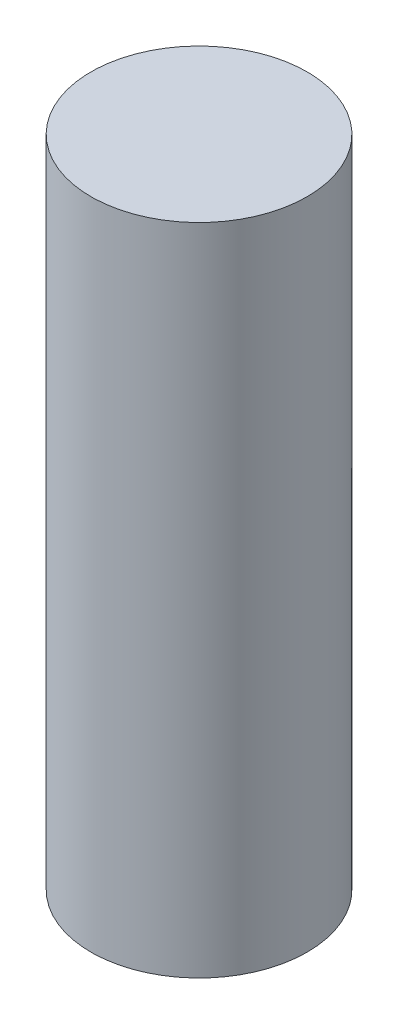
ISO-10303-21;
HEADER;
FILE_DESCRIPTION(('STEP AP214'),'2;1');
FILE_NAME('part.step','',(''),(''),'','','');
FILE_SCHEMA(('AUTOMOTIVE_DESIGN { 1 0 10303 214 1 1 1 1 }'));
ENDSEC;
DATA;
#1=APPLICATION_CONTEXT('core data for automotive mechanical design processes');
#2=APPLICATION_PROTOCOL_DEFINITION('international standard','automotive_design',2000,#1);
#3=PRODUCT_CONTEXT('',#1,'mechanical');
#4=PRODUCT('Part','Part','',(#3));
#5=PRODUCT_RELATED_PRODUCT_CATEGORY('part','',(#4));
#6=PRODUCT_DEFINITION_FORMATION('','',#4);
#7=PRODUCT_DEFINITION_CONTEXT('part definition',#1,'design');
#8=PRODUCT_DEFINITION('design','',#6,#7);
#9=PRODUCT_DEFINITION_SHAPE('','',#8);
#10=(LENGTH_UNIT() NAMED_UNIT(*) SI_UNIT(.MILLI.,.METRE.));
#11=(NAMED_UNIT(*) PLANE_ANGLE_UNIT() SI_UNIT($,.RADIAN.));
#12=(NAMED_UNIT(*) SI_UNIT($,.STERADIAN.) SOLID_ANGLE_UNIT());
#13=UNCERTAINTY_MEASURE_WITH_UNIT(LENGTH_MEASURE(1.E-05),#10,'distance_accuracy_value','');
#14=(GEOMETRIC_REPRESENTATION_CONTEXT(3) GLOBAL_UNCERTAINTY_ASSIGNED_CONTEXT((#13)) GLOBAL_UNIT_ASSIGNED_CONTEXT((#10,
#11,#12)) REPRESENTATION_CONTEXT('',''));
#15=CARTESIAN_POINT('',(0.,0.,0.));
#16=DIRECTION('',(0.,0.,1.));
#17=DIRECTION('',(1.,0.,0.));
#18=AXIS2_PLACEMENT_3D('',#15,#16,#17);
#19=CARTESIAN_POINT('',(0.,19.214,0.));
#20=DIRECTION('',(0.,-1.,0.));
#21=DIRECTION('',(0.,0.,-1.));
#22=AXIS2_PLACEMENT_3D('',#19,#20,#21);
#23=CYLINDRICAL_SURFACE('',#22,3.175);
#24=CARTESIAN_POINT('',(0.,19.214,0.));
#25=DIRECTION('',(0.,1.,0.));
#26=DIRECTION('',(1.,0.,0.));
#27=AXIS2_PLACEMENT_3D('',#24,#25,#26);
#28=CIRCLE('',#27,3.175);
#29=CARTESIAN_POINT('',(3.175,19.214,0.));
#30=VERTEX_POINT('',#29);
#31=EDGE_CURVE('E20',#30,#30,#28,.T.);
#32=ORIENTED_EDGE('',*,*,#31,.F.);
#33=EDGE_LOOP('',(#32));
#34=FACE_BOUND('',#33,.T.);
#35=CARTESIAN_POINT('',(0.,0.,0.));
#36=DIRECTION('',(0.,1.,0.));
#37=DIRECTION('',(1.,0.,0.));
#38=AXIS2_PLACEMENT_3D('',#35,#36,#37);
#39=CIRCLE('',#38,3.175);
#40=CARTESIAN_POINT('',(3.175,0.,0.));
#41=VERTEX_POINT('',#40);
#42=EDGE_CURVE('E10',#41,#41,#39,.T.);
#43=ORIENTED_EDGE('',*,*,#42,.T.);
#44=EDGE_LOOP('',(#43));
#45=FACE_BOUND('',#44,.T.);
#46=ADVANCED_FACE('F14',(#34,#45),#23,.T.);
#47=CARTESIAN_POINT('',(0.,19.214,0.));
#48=DIRECTION('',(0.,1.,0.));
#49=DIRECTION('',(0.,0.,1.));
#50=AXIS2_PLACEMENT_3D('',#47,#48,#49);
#51=PLANE('',#50);
#52=ORIENTED_EDGE('',*,*,#31,.T.);
#53=EDGE_LOOP('',(#52));
#54=FACE_BOUND('',#53,.T.);
#55=ADVANCED_FACE('F26',(#54),#51,.T.);
#56=CARTESIAN_POINT('',(0.,0.,0.));
#57=DIRECTION('',(0.,1.,0.));
#58=DIRECTION('',(0.,0.,1.));
#59=AXIS2_PLACEMENT_3D('',#56,#57,#58);
#60=PLANE('',#59);
#61=ORIENTED_EDGE('',*,*,#42,.F.);
#62=EDGE_LOOP('',(#61));
#63=FACE_BOUND('',#62,.T.);
#64=ADVANCED_FACE('F33',(#63),#60,.F.);
#65=CLOSED_SHELL('',(#46,#55,#64));
#66=MANIFOLD_SOLID_BREP('B1',#65);
#67=ADVANCED_BREP_SHAPE_REPRESENTATION('',(#18,#66),#14);
#68=SHAPE_DEFINITION_REPRESENTATION(#9,#67);
ENDSEC;
END-ISO-10303-21;
